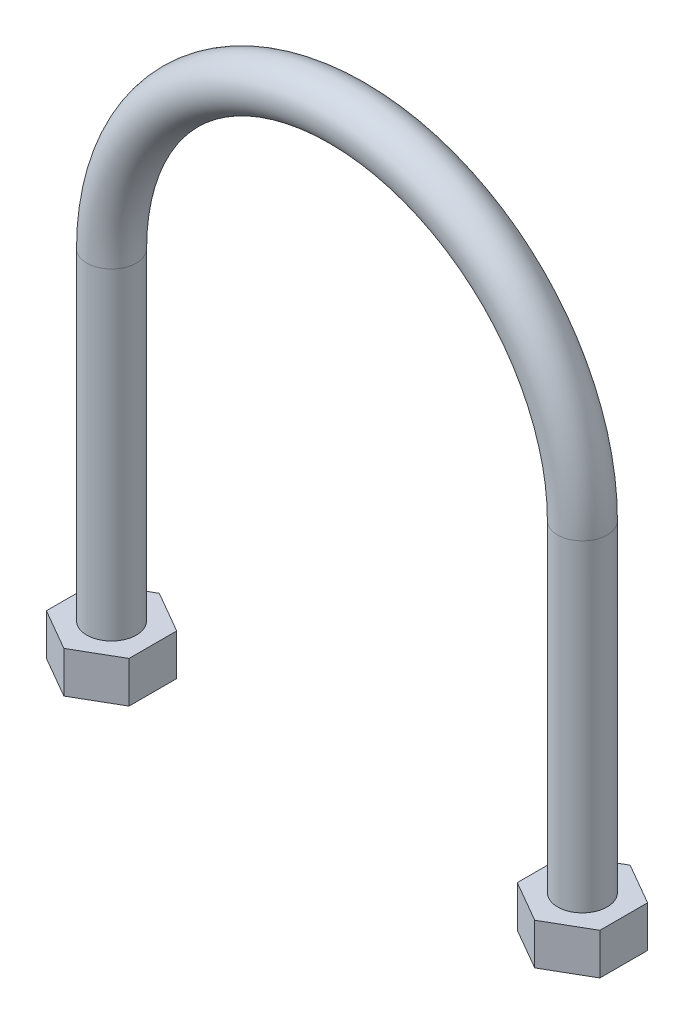
ISO-10303-21;
HEADER;
FILE_DESCRIPTION(('STEP AP214'),'2;1');
FILE_NAME('part.step','',(''),(''),'','','');
FILE_SCHEMA(('AUTOMOTIVE_DESIGN { 1 0 10303 214 1 1 1 1 }'));
ENDSEC;
DATA;
#1=APPLICATION_CONTEXT('core data for automotive mechanical design processes');
#2=APPLICATION_PROTOCOL_DEFINITION('international standard','automotive_design',2000,#1);
#3=PRODUCT_CONTEXT('',#1,'mechanical');
#4=PRODUCT('Part','Part','',(#3));
#5=PRODUCT_RELATED_PRODUCT_CATEGORY('part','',(#4));
#6=PRODUCT_DEFINITION_FORMATION('','',#4);
#7=PRODUCT_DEFINITION_CONTEXT('part definition',#1,'design');
#8=PRODUCT_DEFINITION('design','',#6,#7);
#9=PRODUCT_DEFINITION_SHAPE('','',#8);
#10=(LENGTH_UNIT() NAMED_UNIT(*) SI_UNIT(.MILLI.,.METRE.));
#11=(NAMED_UNIT(*) PLANE_ANGLE_UNIT() SI_UNIT($,.RADIAN.));
#12=(NAMED_UNIT(*) SI_UNIT($,.STERADIAN.) SOLID_ANGLE_UNIT());
#13=UNCERTAINTY_MEASURE_WITH_UNIT(LENGTH_MEASURE(1.E-05),#10,'distance_accuracy_value','');
#14=(GEOMETRIC_REPRESENTATION_CONTEXT(3) GLOBAL_UNCERTAINTY_ASSIGNED_CONTEXT((#13)) GLOBAL_UNIT_ASSIGNED_CONTEXT((#10,
#11,#12)) REPRESENTATION_CONTEXT('',''));
#15=CARTESIAN_POINT('',(0.,0.,0.));
#16=DIRECTION('',(0.,0.,1.));
#17=DIRECTION('',(1.,0.,0.));
#18=AXIS2_PLACEMENT_3D('',#15,#16,#17);
#19=CARTESIAN_POINT('',(28.5,0.,0.));
#20=DIRECTION('',(0.,-1.,0.));
#21=DIRECTION('',(1.,0.,0.));
#22=AXIS2_PLACEMENT_3D('',#19,#20,#21);
#23=CYLINDRICAL_SURFACE('',#22,3.);
#24=CARTESIAN_POINT('',(28.5,0.,0.));
#25=DIRECTION('',(0.,1.,0.));
#26=DIRECTION('',(-1.,0.,0.));
#27=AXIS2_PLACEMENT_3D('',#24,#25,#26);
#28=CIRCLE('',#27,3.);
#29=CARTESIAN_POINT('',(31.5,0.,0.));
#30=VERTEX_POINT('',#29);
#31=EDGE_CURVE('E54',#30,#30,#28,.T.);
#32=ORIENTED_EDGE('',*,*,#31,.F.);
#33=EDGE_LOOP('',(#32));
#34=FACE_BOUND('',#33,.T.);
#35=CARTESIAN_POINT('',(28.5,-39.,0.));
#36=DIRECTION('',(0.,-1.,0.));
#37=DIRECTION('',(0.,0.,-1.));
#38=AXIS2_PLACEMENT_3D('',#35,#36,#37);
#39=CIRCLE('',#38,3.);
#40=CARTESIAN_POINT('',(28.5,-39.,-3.));
#41=VERTEX_POINT('',#40);
#42=EDGE_CURVE('E12',#41,#41,#39,.T.);
#43=ORIENTED_EDGE('',*,*,#42,.F.);
#44=EDGE_LOOP('',(#43));
#45=FACE_BOUND('',#44,.T.);
#46=ADVANCED_FACE('F46',(#34,#45),#23,.T.);
#47=CARTESIAN_POINT('',(-28.5,-42.5,0.));
#48=DIRECTION('',(0.,1.,0.));
#49=DIRECTION('',(-1.,0.,0.));
#50=AXIS2_PLACEMENT_3D('',#47,#48,#49);
#51=CYLINDRICAL_SURFACE('',#50,3.);
#52=CARTESIAN_POINT('',(-28.5,-39.,0.));
#53=DIRECTION('',(0.,1.,0.));
#54=DIRECTION('',(0.,0.,1.));
#55=AXIS2_PLACEMENT_3D('',#52,#53,#54);
#56=CIRCLE('',#55,3.);
#57=CARTESIAN_POINT('',(-28.5,-39.,3.));
#58=VERTEX_POINT('',#57);
#59=EDGE_CURVE('E155',#58,#58,#56,.T.);
#60=ORIENTED_EDGE('',*,*,#59,.T.);
#61=EDGE_LOOP('',(#60));
#62=FACE_BOUND('',#61,.T.);
#63=CARTESIAN_POINT('',(-28.5,0.,0.));
#64=DIRECTION('',(0.,-1.,0.));
#65=DIRECTION('',(1.,0.,0.));
#66=AXIS2_PLACEMENT_3D('',#63,#64,#65);
#67=CIRCLE('',#66,3.);
#68=CARTESIAN_POINT('',(-31.5,0.,0.));
#69=VERTEX_POINT('',#68);
#70=EDGE_CURVE('E161',#69,#69,#67,.T.);
#71=ORIENTED_EDGE('',*,*,#70,.T.);
#72=EDGE_LOOP('',(#71));
#73=FACE_BOUND('',#72,.T.);
#74=ADVANCED_FACE('F168',(#62,#73),#51,.T.);
#75=CARTESIAN_POINT('',(0.,0.,0.));
#76=DIRECTION('',(0.,0.,-1.));
#77=DIRECTION('',(-1.,0.,0.));
#78=AXIS2_PLACEMENT_3D('',#75,#76,#77);
#79=TOROIDAL_SURFACE('',#78,28.5,3.);
#80=CARTESIAN_POINT('',(0.,0.,0.));
#81=DIRECTION('',(0.,0.,-1.));
#82=DIRECTION('',(-1.,0.,0.));
#83=AXIS2_PLACEMENT_3D('',#80,#81,#82);
#84=CIRCLE('',#83,31.5);
#85=EDGE_CURVE('',#69,#30,#84,.T.);
#86=ORIENTED_EDGE('',*,*,#70,.F.);
#87=ORIENTED_EDGE('',*,*,#31,.T.);
#88=ORIENTED_EDGE('',*,*,#85,.T.);
#89=ORIENTED_EDGE('',*,*,#85,.F.);
#90=EDGE_LOOP('',(#86,#88,#87,#89));
#91=FACE_BOUND('',#90,.T.);
#92=ADVANCED_FACE('F189',(#91),#79,.T.);
#93=CARTESIAN_POINT('',(-23.5,-44.,-2.88675134594813));
#94=DIRECTION('',(0.5,0.,-0.866025403784439));
#95=DIRECTION('',(-0.866025403784439,0.,-0.5));
#96=AXIS2_PLACEMENT_3D('',#93,#94,#95);
#97=PLANE('',#96);
#98=DIRECTION('',(-0.866025403784439,0.,-0.5));
#99=VECTOR('',#98,1.);
#100=CARTESIAN_POINT('',(-23.5,-39.,-2.88675134594813));
#101=LINE('',#100,#99);
#102=CARTESIAN_POINT('',(-23.5,-39.,-2.88675134594813));
#103=VERTEX_POINT('',#102);
#104=CARTESIAN_POINT('',(-28.5,-39.,-5.77350269189626));
#105=VERTEX_POINT('',#104);
#106=EDGE_CURVE('E137',#103,#105,#101,.T.);
#107=ORIENTED_EDGE('',*,*,#106,.F.);
#108=DIRECTION('',(0.,1.,0.));
#109=VECTOR('',#108,1.);
#110=CARTESIAN_POINT('',(-23.5,-44.,-2.88675134594813));
#111=LINE('',#110,#109);
#112=CARTESIAN_POINT('',(-23.5,-44.,-2.88675134594813));
#113=VERTEX_POINT('',#112);
#114=EDGE_CURVE('E62',#113,#103,#111,.T.);
#115=ORIENTED_EDGE('',*,*,#114,.F.);
#116=DIRECTION('',(-0.866025403784439,0.,-0.5));
#117=VECTOR('',#116,1.);
#118=CARTESIAN_POINT('',(-23.5,-44.,-2.88675134594813));
#119=LINE('',#118,#117);
#120=CARTESIAN_POINT('',(-28.5,-44.,-5.77350269189626));
#121=VERTEX_POINT('',#120);
#122=EDGE_CURVE('E153',#113,#121,#119,.T.);
#123=ORIENTED_EDGE('',*,*,#122,.T.);
#124=DIRECTION('',(0.,1.,0.));
#125=VECTOR('',#124,1.);
#126=CARTESIAN_POINT('',(-28.5,-44.,-5.77350269189626));
#127=LINE('',#126,#125);
#128=EDGE_CURVE('E98',#121,#105,#127,.T.);
#129=ORIENTED_EDGE('',*,*,#128,.T.);
#130=EDGE_LOOP('',(#107,#115,#123,#129));
#131=FACE_BOUND('',#130,.T.);
#132=ADVANCED_FACE('F176',(#131),#97,.T.);
#133=CARTESIAN_POINT('',(-23.5,-44.,2.88675134594813));
#134=DIRECTION('',(1.,0.,0.));
#135=DIRECTION('',(0.,0.,-1.));
#136=AXIS2_PLACEMENT_3D('',#133,#134,#135);
#137=PLANE('',#136);
#138=DIRECTION('',(0.,0.,-1.));
#139=VECTOR('',#138,1.);
#140=CARTESIAN_POINT('',(-23.5,-39.,2.88675134594813));
#141=LINE('',#140,#139);
#142=CARTESIAN_POINT('',(-23.5,-39.,2.88675134594813));
#143=VERTEX_POINT('',#142);
#144=EDGE_CURVE('E150',#143,#103,#141,.T.);
#145=ORIENTED_EDGE('',*,*,#144,.F.);
#146=DIRECTION('',(0.,1.,0.));
#147=VECTOR('',#146,1.);
#148=CARTESIAN_POINT('',(-23.5,-44.,2.88675134594813));
#149=LINE('',#148,#147);
#150=CARTESIAN_POINT('',(-23.5,-44.,2.88675134594813));
#151=VERTEX_POINT('',#150);
#152=EDGE_CURVE('E86',#151,#143,#149,.T.);
#153=ORIENTED_EDGE('',*,*,#152,.F.);
#154=DIRECTION('',(0.,0.,-1.));
#155=VECTOR('',#154,1.);
#156=CARTESIAN_POINT('',(-23.5,-44.,2.88675134594813));
#157=LINE('',#156,#155);
#158=EDGE_CURVE('E127',#151,#113,#157,.T.);
#159=ORIENTED_EDGE('',*,*,#158,.T.);
#160=ORIENTED_EDGE('',*,*,#114,.T.);
#161=EDGE_LOOP('',(#145,#153,#159,#160));
#162=FACE_BOUND('',#161,.T.);
#163=ADVANCED_FACE('F181',(#162),#137,.T.);
#164=CARTESIAN_POINT('',(-28.5,-44.,5.77350269189626));
#165=DIRECTION('',(0.5,0.,0.866025403784439));
#166=DIRECTION('',(0.866025403784439,0.,-0.5));
#167=AXIS2_PLACEMENT_3D('',#164,#165,#166);
#168=PLANE('',#167);
#169=DIRECTION('',(0.866025403784439,0.,-0.5));
#170=VECTOR('',#169,1.);
#171=CARTESIAN_POINT('',(-28.5,-39.,5.77350269189626));
#172=LINE('',#171,#170);
#173=CARTESIAN_POINT('',(-28.5,-39.,5.77350269189626));
#174=VERTEX_POINT('',#173);
#175=EDGE_CURVE('E114',#174,#143,#172,.T.);
#176=ORIENTED_EDGE('',*,*,#175,.F.);
#177=DIRECTION('',(0.,1.,0.));
#178=VECTOR('',#177,1.);
#179=CARTESIAN_POINT('',(-28.5,-44.,5.77350269189626));
#180=LINE('',#179,#178);
#181=CARTESIAN_POINT('',(-28.5,-44.,5.77350269189626));
#182=VERTEX_POINT('',#181);
#183=EDGE_CURVE('E109',#182,#174,#180,.T.);
#184=ORIENTED_EDGE('',*,*,#183,.F.);
#185=DIRECTION('',(0.866025403784439,0.,-0.5));
#186=VECTOR('',#185,1.);
#187=CARTESIAN_POINT('',(-28.5,-44.,5.77350269189626));
#188=LINE('',#187,#186);
#189=EDGE_CURVE('E112',#182,#151,#188,.T.);
#190=ORIENTED_EDGE('',*,*,#189,.T.);
#191=ORIENTED_EDGE('',*,*,#152,.T.);
#192=EDGE_LOOP('',(#176,#184,#190,#191));
#193=FACE_BOUND('',#192,.T.);
#194=ADVANCED_FACE('F111',(#193),#168,.T.);
#195=CARTESIAN_POINT('',(-33.5,-44.,2.88675134594813));
#196=DIRECTION('',(-0.5,0.,0.866025403784439));
#197=DIRECTION('',(0.866025403784439,0.,0.5));
#198=AXIS2_PLACEMENT_3D('',#195,#196,#197);
#199=PLANE('',#198);
#200=DIRECTION('',(0.866025403784439,0.,0.5));
#201=VECTOR('',#200,1.);
#202=CARTESIAN_POINT('',(-33.5,-39.,2.88675134594813));
#203=LINE('',#202,#201);
#204=CARTESIAN_POINT('',(-33.5,-39.,2.88675134594813));
#205=VERTEX_POINT('',#204);
#206=EDGE_CURVE('E147',#205,#174,#203,.T.);
#207=ORIENTED_EDGE('',*,*,#206,.F.);
#208=DIRECTION('',(0.,1.,0.));
#209=VECTOR('',#208,1.);
#210=CARTESIAN_POINT('',(-33.5,-44.,2.88675134594813));
#211=LINE('',#210,#209);
#212=CARTESIAN_POINT('',(-33.5,-44.,2.88675134594813));
#213=VERTEX_POINT('',#212);
#214=EDGE_CURVE('E119',#213,#205,#211,.T.);
#215=ORIENTED_EDGE('',*,*,#214,.F.);
#216=DIRECTION('',(0.866025403784439,0.,0.5));
#217=VECTOR('',#216,1.);
#218=CARTESIAN_POINT('',(-33.5,-44.,2.88675134594813));
#219=LINE('',#218,#217);
#220=EDGE_CURVE('E125',#213,#182,#219,.T.);
#221=ORIENTED_EDGE('',*,*,#220,.T.);
#222=ORIENTED_EDGE('',*,*,#183,.T.);
#223=EDGE_LOOP('',(#207,#215,#221,#222));
#224=FACE_BOUND('',#223,.T.);
#225=ADVANCED_FACE('F129',(#224),#199,.T.);
#226=CARTESIAN_POINT('',(-33.5,-44.,-2.88675134594813));
#227=DIRECTION('',(-1.,0.,0.));
#228=DIRECTION('',(0.,0.,1.));
#229=AXIS2_PLACEMENT_3D('',#226,#227,#228);
#230=PLANE('',#229);
#231=DIRECTION('',(0.,0.,1.));
#232=VECTOR('',#231,1.);
#233=CARTESIAN_POINT('',(-33.5,-39.,-2.88675134594813));
#234=LINE('',#233,#232);
#235=CARTESIAN_POINT('',(-33.5,-39.,-2.88675134594813));
#236=VERTEX_POINT('',#235);
#237=EDGE_CURVE('E144',#236,#205,#234,.T.);
#238=ORIENTED_EDGE('',*,*,#237,.F.);
#239=DIRECTION('',(0.,1.,0.));
#240=VECTOR('',#239,1.);
#241=CARTESIAN_POINT('',(-33.5,-44.,-2.88675134594813));
#242=LINE('',#241,#240);
#243=CARTESIAN_POINT('',(-33.5,-44.,-2.88675134594813));
#244=VERTEX_POINT('',#243);
#245=EDGE_CURVE('E158',#244,#236,#242,.T.);
#246=ORIENTED_EDGE('',*,*,#245,.F.);
#247=DIRECTION('',(0.,0.,1.));
#248=VECTOR('',#247,1.);
#249=CARTESIAN_POINT('',(-33.5,-44.,-2.88675134594813));
#250=LINE('',#249,#248);
#251=EDGE_CURVE('E130',#244,#213,#250,.T.);
#252=ORIENTED_EDGE('',*,*,#251,.T.);
#253=ORIENTED_EDGE('',*,*,#214,.T.);
#254=EDGE_LOOP('',(#238,#246,#252,#253));
#255=FACE_BOUND('',#254,.T.);
#256=ADVANCED_FACE('F180',(#255),#230,.T.);
#257=CARTESIAN_POINT('',(-28.5,-44.,-5.77350269189626));
#258=DIRECTION('',(-0.5,0.,-0.866025403784439));
#259=DIRECTION('',(-0.866025403784439,0.,0.5));
#260=AXIS2_PLACEMENT_3D('',#257,#258,#259);
#261=PLANE('',#260);
#262=DIRECTION('',(-0.866025403784439,0.,0.5));
#263=VECTOR('',#262,1.);
#264=CARTESIAN_POINT('',(-28.5,-39.,-5.77350269189626));
#265=LINE('',#264,#263);
#266=EDGE_CURVE('E140',#105,#236,#265,.T.);
#267=ORIENTED_EDGE('',*,*,#266,.F.);
#268=ORIENTED_EDGE('',*,*,#128,.F.);
#269=DIRECTION('',(-0.866025403784439,0.,0.5));
#270=VECTOR('',#269,1.);
#271=CARTESIAN_POINT('',(-28.5,-44.,-5.77350269189626));
#272=LINE('',#271,#270);
#273=EDGE_CURVE('E132',#121,#244,#272,.T.);
#274=ORIENTED_EDGE('',*,*,#273,.T.);
#275=ORIENTED_EDGE('',*,*,#245,.T.);
#276=EDGE_LOOP('',(#267,#268,#274,#275));
#277=FACE_BOUND('',#276,.T.);
#278=ADVANCED_FACE('F177',(#277),#261,.T.);
#279=CARTESIAN_POINT('',(0.,-44.,0.));
#280=DIRECTION('',(0.,1.,0.));
#281=DIRECTION('',(0.,0.,1.));
#282=AXIS2_PLACEMENT_3D('',#279,#280,#281);
#283=PLANE('',#282);
#284=ORIENTED_EDGE('',*,*,#122,.F.);
#285=ORIENTED_EDGE('',*,*,#158,.F.);
#286=ORIENTED_EDGE('',*,*,#189,.F.);
#287=ORIENTED_EDGE('',*,*,#220,.F.);
#288=ORIENTED_EDGE('',*,*,#251,.F.);
#289=ORIENTED_EDGE('',*,*,#273,.F.);
#290=EDGE_LOOP('',(#284,#285,#286,#287,#288,#289));
#291=FACE_BOUND('',#290,.T.);
#292=ADVANCED_FACE('F123',(#291),#283,.F.);
#293=CARTESIAN_POINT('',(0.,-39.,0.));
#294=DIRECTION('',(0.,1.,0.));
#295=DIRECTION('',(0.,0.,1.));
#296=AXIS2_PLACEMENT_3D('',#293,#294,#295);
#297=PLANE('',#296);
#298=ORIENTED_EDGE('',*,*,#59,.F.);
#299=EDGE_LOOP('',(#298));
#300=FACE_BOUND('',#299,.T.);
#301=ORIENTED_EDGE('',*,*,#106,.T.);
#302=ORIENTED_EDGE('',*,*,#266,.T.);
#303=ORIENTED_EDGE('',*,*,#237,.T.);
#304=ORIENTED_EDGE('',*,*,#206,.T.);
#305=ORIENTED_EDGE('',*,*,#175,.T.);
#306=ORIENTED_EDGE('',*,*,#144,.T.);
#307=EDGE_LOOP('',(#301,#302,#303,#304,#305,#306));
#308=FACE_BOUND('',#307,.T.);
#309=ADVANCED_FACE('F171',(#300,#308),#297,.T.);
#310=CARTESIAN_POINT('',(23.5,-44.,2.88675134594813));
#311=DIRECTION('',(-1.,0.,0.));
#312=DIRECTION('',(0.,0.,1.));
#313=AXIS2_PLACEMENT_3D('',#310,#311,#312);
#314=PLANE('',#313);
#315=DIRECTION('',(0.,0.,1.));
#316=VECTOR('',#315,1.);
#317=CARTESIAN_POINT('',(23.5,-39.,2.88675134594813));
#318=LINE('',#317,#316);
#319=CARTESIAN_POINT('',(23.5,-39.,-2.88675134594813));
#320=VERTEX_POINT('',#319);
#321=CARTESIAN_POINT('',(23.5,-39.,2.88675134594813));
#322=VERTEX_POINT('',#321);
#323=EDGE_CURVE('E358',#320,#322,#318,.T.);
#324=ORIENTED_EDGE('',*,*,#323,.F.);
#325=DIRECTION('',(0.,1.,0.));
#326=VECTOR('',#325,1.);
#327=CARTESIAN_POINT('',(23.5,-44.,-2.88675134594813));
#328=LINE('',#327,#326);
#329=CARTESIAN_POINT('',(23.5,-44.,-2.88675134594813));
#330=VERTEX_POINT('',#329);
#331=EDGE_CURVE('E141',#330,#320,#328,.T.);
#332=ORIENTED_EDGE('',*,*,#331,.F.);
#333=DIRECTION('',(0.,0.,1.));
#334=VECTOR('',#333,1.);
#335=CARTESIAN_POINT('',(23.5,-44.,2.88675134594813));
#336=LINE('',#335,#334);
#337=CARTESIAN_POINT('',(23.5,-44.,2.88675134594813));
#338=VERTEX_POINT('',#337);
#339=EDGE_CURVE('E383',#330,#338,#336,.T.);
#340=ORIENTED_EDGE('',*,*,#339,.T.);
#341=DIRECTION('',(0.,1.,0.));
#342=VECTOR('',#341,1.);
#343=CARTESIAN_POINT('',(23.5,-44.,2.88675134594813));
#344=LINE('',#343,#342);
#345=EDGE_CURVE('E398',#338,#322,#344,.T.);
#346=ORIENTED_EDGE('',*,*,#345,.T.);
#347=EDGE_LOOP('',(#324,#332,#340,#346));
#348=FACE_BOUND('',#347,.T.);
#349=ADVANCED_FACE('F174',(#348),#314,.T.);
#350=CARTESIAN_POINT('',(23.5,-44.,-2.88675134594813));
#351=DIRECTION('',(-0.5,0.,-0.866025403784439));
#352=DIRECTION('',(-0.866025403784439,0.,0.5));
#353=AXIS2_PLACEMENT_3D('',#350,#351,#352);
#354=PLANE('',#353);
#355=DIRECTION('',(-0.866025403784439,0.,0.5));
#356=VECTOR('',#355,1.);
#357=CARTESIAN_POINT('',(23.5,-39.,-2.88675134594813));
#358=LINE('',#357,#356);
#359=CARTESIAN_POINT('',(28.5,-39.,-5.77350269189625));
#360=VERTEX_POINT('',#359);
#361=EDGE_CURVE('E365',#360,#320,#358,.T.);
#362=ORIENTED_EDGE('',*,*,#361,.F.);
#363=DIRECTION('',(0.,1.,0.));
#364=VECTOR('',#363,1.);
#365=CARTESIAN_POINT('',(28.5,-44.,-5.77350269189625));
#366=LINE('',#365,#364);
#367=CARTESIAN_POINT('',(28.5,-44.,-5.77350269189625));
#368=VERTEX_POINT('',#367);
#369=EDGE_CURVE('E386',#368,#360,#366,.T.);
#370=ORIENTED_EDGE('',*,*,#369,.F.);
#371=DIRECTION('',(-0.866025403784439,0.,0.5));
#372=VECTOR('',#371,1.);
#373=CARTESIAN_POINT('',(23.5,-44.,-2.88675134594813));
#374=LINE('',#373,#372);
#375=EDGE_CURVE('E373',#368,#330,#374,.T.);
#376=ORIENTED_EDGE('',*,*,#375,.T.);
#377=ORIENTED_EDGE('',*,*,#331,.T.);
#378=EDGE_LOOP('',(#362,#370,#376,#377));
#379=FACE_BOUND('',#378,.T.);
#380=ADVANCED_FACE('F238',(#379),#354,.T.);
#381=CARTESIAN_POINT('',(28.5,-44.,-5.77350269189625));
#382=DIRECTION('',(0.5,0.,-0.866025403784439));
#383=DIRECTION('',(-0.866025403784439,0.,-0.5));
#384=AXIS2_PLACEMENT_3D('',#381,#382,#383);
#385=PLANE('',#384);
#386=DIRECTION('',(-0.866025403784439,0.,-0.5));
#387=VECTOR('',#386,1.);
#388=CARTESIAN_POINT('',(28.5,-39.,-5.77350269189625));
#389=LINE('',#388,#387);
#390=CARTESIAN_POINT('',(33.5,-39.,-2.88675134594813));
#391=VERTEX_POINT('',#390);
#392=EDGE_CURVE('E380',#391,#360,#389,.T.);
#393=ORIENTED_EDGE('',*,*,#392,.F.);
#394=DIRECTION('',(0.,1.,0.));
#395=VECTOR('',#394,1.);
#396=CARTESIAN_POINT('',(33.5,-44.,-2.88675134594813));
#397=LINE('',#396,#395);
#398=CARTESIAN_POINT('',(33.5,-44.,-2.88675134594813));
#399=VERTEX_POINT('',#398);
#400=EDGE_CURVE('E389',#399,#391,#397,.T.);
#401=ORIENTED_EDGE('',*,*,#400,.F.);
#402=DIRECTION('',(-0.866025403784439,0.,-0.5));
#403=VECTOR('',#402,1.);
#404=CARTESIAN_POINT('',(28.5,-44.,-5.77350269189625));
#405=LINE('',#404,#403);
#406=EDGE_CURVE('E403',#399,#368,#405,.T.);
#407=ORIENTED_EDGE('',*,*,#406,.T.);
#408=ORIENTED_EDGE('',*,*,#369,.T.);
#409=EDGE_LOOP('',(#393,#401,#407,#408));
#410=FACE_BOUND('',#409,.T.);
#411=ADVANCED_FACE('F246',(#410),#385,.T.);
#412=CARTESIAN_POINT('',(33.5,-44.,-2.88675134594813));
#413=DIRECTION('',(1.,0.,0.));
#414=DIRECTION('',(0.,0.,-1.));
#415=AXIS2_PLACEMENT_3D('',#412,#413,#414);
#416=PLANE('',#415);
#417=DIRECTION('',(0.,0.,-1.));
#418=VECTOR('',#417,1.);
#419=CARTESIAN_POINT('',(33.5,-39.,-2.88675134594813));
#420=LINE('',#419,#418);
#421=CARTESIAN_POINT('',(33.5,-39.,2.88675134594813));
#422=VERTEX_POINT('',#421);
#423=EDGE_CURVE('E377',#422,#391,#420,.T.);
#424=ORIENTED_EDGE('',*,*,#423,.F.);
#425=DIRECTION('',(0.,1.,0.));
#426=VECTOR('',#425,1.);
#427=CARTESIAN_POINT('',(33.5,-44.,2.88675134594813));
#428=LINE('',#427,#426);
#429=CARTESIAN_POINT('',(33.5,-44.,2.88675134594813));
#430=VERTEX_POINT('',#429);
#431=EDGE_CURVE('E392',#430,#422,#428,.T.);
#432=ORIENTED_EDGE('',*,*,#431,.F.);
#433=DIRECTION('',(0.,0.,-1.));
#434=VECTOR('',#433,1.);
#435=CARTESIAN_POINT('',(33.5,-44.,-2.88675134594813));
#436=LINE('',#435,#434);
#437=EDGE_CURVE('E407',#430,#399,#436,.T.);
#438=ORIENTED_EDGE('',*,*,#437,.T.);
#439=ORIENTED_EDGE('',*,*,#400,.T.);
#440=EDGE_LOOP('',(#424,#432,#438,#439));
#441=FACE_BOUND('',#440,.T.);
#442=ADVANCED_FACE('F254',(#441),#416,.T.);
#443=CARTESIAN_POINT('',(33.5,-44.,2.88675134594813));
#444=DIRECTION('',(0.5,0.,0.866025403784439));
#445=DIRECTION('',(0.866025403784439,0.,-0.5));
#446=AXIS2_PLACEMENT_3D('',#443,#444,#445);
#447=PLANE('',#446);
#448=DIRECTION('',(0.866025403784439,0.,-0.5));
#449=VECTOR('',#448,1.);
#450=CARTESIAN_POINT('',(33.5,-39.,2.88675134594813));
#451=LINE('',#450,#449);
#452=CARTESIAN_POINT('',(28.5,-39.,5.77350269189625));
#453=VERTEX_POINT('',#452);
#454=EDGE_CURVE('E370',#453,#422,#451,.T.);
#455=ORIENTED_EDGE('',*,*,#454,.F.);
#456=DIRECTION('',(0.,1.,0.));
#457=VECTOR('',#456,1.);
#458=CARTESIAN_POINT('',(28.5,-44.,5.77350269189625));
#459=LINE('',#458,#457);
#460=CARTESIAN_POINT('',(28.5,-44.,5.77350269189625));
#461=VERTEX_POINT('',#460);
#462=EDGE_CURVE('E395',#461,#453,#459,.T.);
#463=ORIENTED_EDGE('',*,*,#462,.F.);
#464=DIRECTION('',(0.866025403784439,0.,-0.5));
#465=VECTOR('',#464,1.);
#466=CARTESIAN_POINT('',(33.5,-44.,2.88675134594813));
#467=LINE('',#466,#465);
#468=EDGE_CURVE('E412',#461,#430,#467,.T.);
#469=ORIENTED_EDGE('',*,*,#468,.T.);
#470=ORIENTED_EDGE('',*,*,#431,.T.);
#471=EDGE_LOOP('',(#455,#463,#469,#470));
#472=FACE_BOUND('',#471,.T.);
#473=ADVANCED_FACE('F262',(#472),#447,.T.);
#474=CARTESIAN_POINT('',(28.5,-44.,5.77350269189625));
#475=DIRECTION('',(-0.5,0.,0.866025403784439));
#476=DIRECTION('',(0.866025403784439,0.,0.5));
#477=AXIS2_PLACEMENT_3D('',#474,#475,#476);
#478=PLANE('',#477);
#479=DIRECTION('',(0.866025403784439,0.,0.5));
#480=VECTOR('',#479,1.);
#481=CARTESIAN_POINT('',(28.5,-39.,5.77350269189625));
#482=LINE('',#481,#480);
#483=EDGE_CURVE('E362',#322,#453,#482,.T.);
#484=ORIENTED_EDGE('',*,*,#483,.F.);
#485=ORIENTED_EDGE('',*,*,#345,.F.);
#486=DIRECTION('',(0.866025403784439,0.,0.5));
#487=VECTOR('',#486,1.);
#488=CARTESIAN_POINT('',(28.5,-44.,5.77350269189625));
#489=LINE('',#488,#487);
#490=EDGE_CURVE('E417',#338,#461,#489,.T.);
#491=ORIENTED_EDGE('',*,*,#490,.T.);
#492=ORIENTED_EDGE('',*,*,#462,.T.);
#493=EDGE_LOOP('',(#484,#485,#491,#492));
#494=FACE_BOUND('',#493,.T.);
#495=ADVANCED_FACE('F270',(#494),#478,.T.);
#496=CARTESIAN_POINT('',(0.,-44.,0.));
#497=DIRECTION('',(0.,-1.,0.));
#498=DIRECTION('',(0.,0.,-1.));
#499=AXIS2_PLACEMENT_3D('',#496,#497,#498);
#500=PLANE('',#499);
#501=ORIENTED_EDGE('',*,*,#339,.F.);
#502=ORIENTED_EDGE('',*,*,#375,.F.);
#503=ORIENTED_EDGE('',*,*,#406,.F.);
#504=ORIENTED_EDGE('',*,*,#437,.F.);
#505=ORIENTED_EDGE('',*,*,#468,.F.);
#506=ORIENTED_EDGE('',*,*,#490,.F.);
#507=EDGE_LOOP('',(#501,#502,#503,#504,#505,#506));
#508=FACE_BOUND('',#507,.T.);
#509=ADVANCED_FACE('F278',(#508),#500,.T.);
#510=CARTESIAN_POINT('',(0.,-39.,0.));
#511=DIRECTION('',(0.,-1.,0.));
#512=DIRECTION('',(0.,0.,-1.));
#513=AXIS2_PLACEMENT_3D('',#510,#511,#512);
#514=PLANE('',#513);
#515=ORIENTED_EDGE('',*,*,#42,.T.);
#516=EDGE_LOOP('',(#515));
#517=FACE_BOUND('',#516,.T.);
#518=ORIENTED_EDGE('',*,*,#323,.T.);
#519=ORIENTED_EDGE('',*,*,#483,.T.);
#520=ORIENTED_EDGE('',*,*,#454,.T.);
#521=ORIENTED_EDGE('',*,*,#423,.T.);
#522=ORIENTED_EDGE('',*,*,#392,.T.);
#523=ORIENTED_EDGE('',*,*,#361,.T.);
#524=EDGE_LOOP('',(#518,#519,#520,#521,#522,#523));
#525=FACE_BOUND('',#524,.T.);
#526=ADVANCED_FACE('F286',(#517,#525),#514,.F.);
#527=CLOSED_SHELL('',(#46,#74,#92,#132,#163,#194,#225,#256,#278,#292,#309,#349,#380,#411,#442,
#473,#495,#509,#526));
#528=MANIFOLD_SOLID_BREP('B2',#527);
#529=ADVANCED_BREP_SHAPE_REPRESENTATION('',(#18,#528),#14);
#530=SHAPE_DEFINITION_REPRESENTATION(#9,#529);
ENDSEC;
END-ISO-10303-21;
